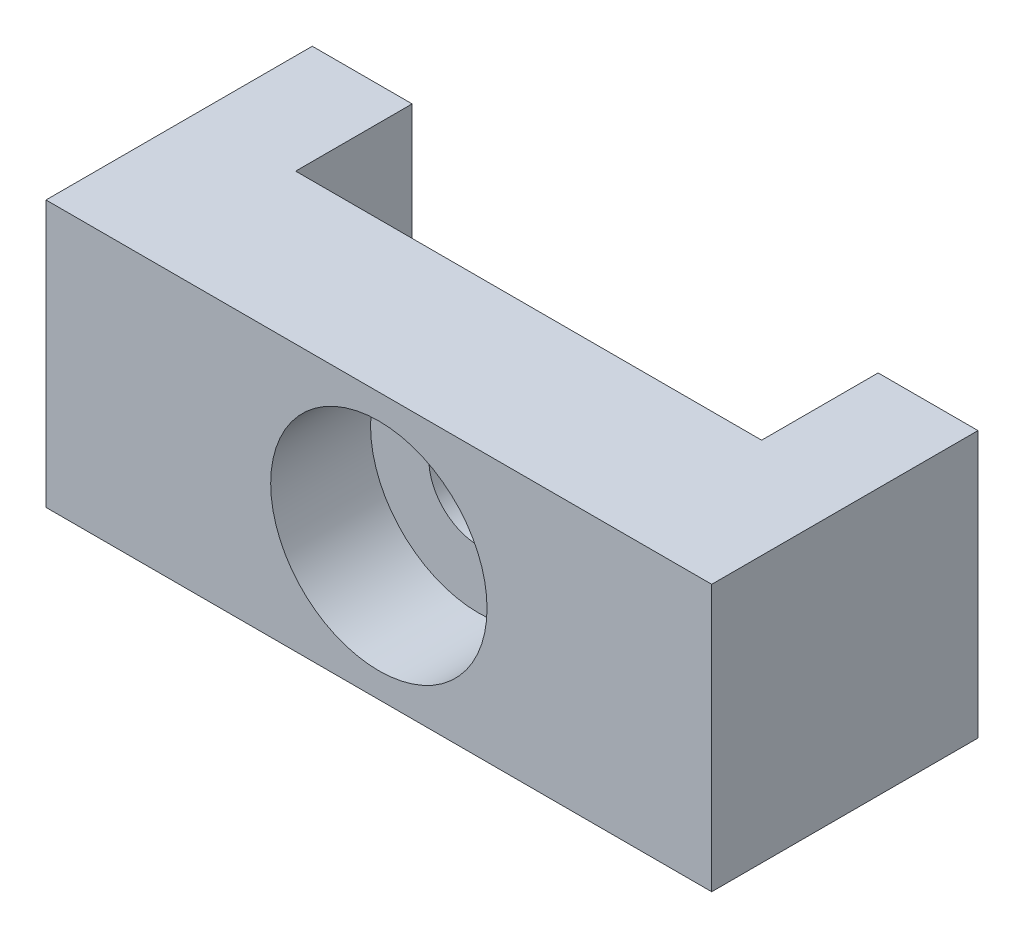
ISO-10303-21;
HEADER;
FILE_DESCRIPTION(('STEP AP214'),'2;1');
FILE_NAME('part.step','',(''),(''),'','','');
FILE_SCHEMA(('AUTOMOTIVE_DESIGN { 1 0 10303 214 1 1 1 1 }'));
ENDSEC;
DATA;
#1=APPLICATION_CONTEXT('core data for automotive mechanical design processes');
#2=APPLICATION_PROTOCOL_DEFINITION('international standard','automotive_design',2000,#1);
#3=PRODUCT_CONTEXT('',#1,'mechanical');
#4=PRODUCT('Part','Part','',(#3));
#5=PRODUCT_RELATED_PRODUCT_CATEGORY('part','',(#4));
#6=PRODUCT_DEFINITION_FORMATION('','',#4);
#7=PRODUCT_DEFINITION_CONTEXT('part definition',#1,'design');
#8=PRODUCT_DEFINITION('design','',#6,#7);
#9=PRODUCT_DEFINITION_SHAPE('','',#8);
#10=(LENGTH_UNIT() NAMED_UNIT(*) SI_UNIT(.MILLI.,.METRE.));
#11=(NAMED_UNIT(*) PLANE_ANGLE_UNIT() SI_UNIT($,.RADIAN.));
#12=(NAMED_UNIT(*) SI_UNIT($,.STERADIAN.) SOLID_ANGLE_UNIT());
#13=UNCERTAINTY_MEASURE_WITH_UNIT(LENGTH_MEASURE(1.E-05),#10,'distance_accuracy_value','');
#14=(GEOMETRIC_REPRESENTATION_CONTEXT(3) GLOBAL_UNCERTAINTY_ASSIGNED_CONTEXT((#13)) GLOBAL_UNIT_ASSIGNED_CONTEXT((#10,
#11,#12)) REPRESENTATION_CONTEXT('',''));
#15=CARTESIAN_POINT('',(0.,0.,0.));
#16=DIRECTION('',(0.,0.,1.));
#17=DIRECTION('',(1.,0.,0.));
#18=AXIS2_PLACEMENT_3D('',#15,#16,#17);
#19=CARTESIAN_POINT('',(0.,0.,-8.));
#20=DIRECTION('',(0.,0.,1.));
#21=DIRECTION('',(1.,0.,0.));
#22=AXIS2_PLACEMENT_3D('',#19,#20,#21);
#23=PLANE('',#22);
#24=DIRECTION('',(-1.,0.,0.));
#25=VECTOR('',#24,1.);
#26=CARTESIAN_POINT('',(10.,4.,-8.));
#27=LINE('',#26,#25);
#28=CARTESIAN_POINT('',(-7.,4.,-8.));
#29=VERTEX_POINT('',#28);
#30=CARTESIAN_POINT('',(-10.,4.,-8.));
#31=VERTEX_POINT('',#30);
#32=EDGE_CURVE('E58',#29,#31,#27,.T.);
#33=ORIENTED_EDGE('',*,*,#32,.F.);
#34=DIRECTION('',(0.,1.,0.));
#35=VECTOR('',#34,1.);
#36=CARTESIAN_POINT('',(-7.,-4.,-8.));
#37=LINE('',#36,#35);
#38=CARTESIAN_POINT('',(-7.,-4.,-8.));
#39=VERTEX_POINT('',#38);
#40=EDGE_CURVE('E111',#39,#29,#37,.T.);
#41=ORIENTED_EDGE('',*,*,#40,.F.);
#42=DIRECTION('',(1.,0.,0.));
#43=VECTOR('',#42,1.);
#44=CARTESIAN_POINT('',(10.,-4.,-8.));
#45=LINE('',#44,#43);
#46=CARTESIAN_POINT('',(-10.,-4.,-8.));
#47=VERTEX_POINT('',#46);
#48=EDGE_CURVE('E146',#47,#39,#45,.T.);
#49=ORIENTED_EDGE('',*,*,#48,.F.);
#50=DIRECTION('',(0.,-1.,0.));
#51=VECTOR('',#50,1.);
#52=CARTESIAN_POINT('',(-10.,-4.,-8.));
#53=LINE('',#52,#51);
#54=EDGE_CURVE('E141',#31,#47,#53,.T.);
#55=ORIENTED_EDGE('',*,*,#54,.F.);
#56=EDGE_LOOP('',(#33,#41,#49,#55));
#57=FACE_BOUND('',#56,.T.);
#58=ADVANCED_FACE('F33',(#57),#23,.F.);
#59=CARTESIAN_POINT('',(-10.,-4.,-8.));
#60=DIRECTION('',(-1.,0.,0.));
#61=DIRECTION('',(0.,0.,1.));
#62=AXIS2_PLACEMENT_3D('',#59,#60,#61);
#63=PLANE('',#62);
#64=DIRECTION('',(0.,-1.,0.));
#65=VECTOR('',#64,1.);
#66=CARTESIAN_POINT('',(-10.,-4.,0.));
#67=LINE('',#66,#65);
#68=CARTESIAN_POINT('',(-10.,4.,0.));
#69=VERTEX_POINT('',#68);
#70=CARTESIAN_POINT('',(-10.,-4.,0.));
#71=VERTEX_POINT('',#70);
#72=EDGE_CURVE('E136',#69,#71,#67,.T.);
#73=ORIENTED_EDGE('',*,*,#72,.F.);
#74=DIRECTION('',(0.,0.,1.));
#75=VECTOR('',#74,1.);
#76=CARTESIAN_POINT('',(-10.,4.,-8.));
#77=LINE('',#76,#75);
#78=EDGE_CURVE('E11',#31,#69,#77,.T.);
#79=ORIENTED_EDGE('',*,*,#78,.F.);
#80=ORIENTED_EDGE('',*,*,#54,.T.);
#81=DIRECTION('',(0.,0.,1.));
#82=VECTOR('',#81,1.);
#83=CARTESIAN_POINT('',(-10.,-4.,-8.));
#84=LINE('',#83,#82);
#85=EDGE_CURVE('E83',#47,#71,#84,.T.);
#86=ORIENTED_EDGE('',*,*,#85,.T.);
#87=EDGE_LOOP('',(#73,#79,#80,#86));
#88=FACE_BOUND('',#87,.T.);
#89=ADVANCED_FACE('F35',(#88),#63,.T.);
#90=CARTESIAN_POINT('',(10.,4.,-8.));
#91=DIRECTION('',(0.,1.,0.));
#92=DIRECTION('',(-1.,0.,0.));
#93=AXIS2_PLACEMENT_3D('',#90,#91,#92);
#94=PLANE('',#93);
#95=DIRECTION('',(0.,0.,-1.));
#96=VECTOR('',#95,1.);
#97=CARTESIAN_POINT('',(-7.,4.,-4.5));
#98=LINE('',#97,#96);
#99=CARTESIAN_POINT('',(-7.,4.,-4.5));
#100=VERTEX_POINT('',#99);
#101=EDGE_CURVE('E105',#100,#29,#98,.T.);
#102=ORIENTED_EDGE('',*,*,#101,.T.);
#103=ORIENTED_EDGE('',*,*,#32,.T.);
#104=ORIENTED_EDGE('',*,*,#78,.T.);
#105=DIRECTION('',(-1.,0.,0.));
#106=VECTOR('',#105,1.);
#107=CARTESIAN_POINT('',(10.,4.,0.));
#108=LINE('',#107,#106);
#109=CARTESIAN_POINT('',(10.,4.,0.));
#110=VERTEX_POINT('',#109);
#111=EDGE_CURVE('E145',#110,#69,#108,.T.);
#112=ORIENTED_EDGE('',*,*,#111,.F.);
#113=DIRECTION('',(0.,0.,1.));
#114=VECTOR('',#113,1.);
#115=CARTESIAN_POINT('',(10.,4.,-8.));
#116=LINE('',#115,#114);
#117=CARTESIAN_POINT('',(10.,4.,-8.));
#118=VERTEX_POINT('',#117);
#119=EDGE_CURVE('E42',#118,#110,#116,.T.);
#120=ORIENTED_EDGE('',*,*,#119,.F.);
#121=CARTESIAN_POINT('',(7.,4.,-8.));
#122=VERTEX_POINT('',#121);
#123=EDGE_CURVE('E151',#118,#122,#27,.T.);
#124=ORIENTED_EDGE('',*,*,#123,.T.);
#125=DIRECTION('',(0.,0.,-1.));
#126=VECTOR('',#125,1.);
#127=CARTESIAN_POINT('',(7.,4.,-4.5));
#128=LINE('',#127,#126);
#129=CARTESIAN_POINT('',(7.,4.,-4.5));
#130=VERTEX_POINT('',#129);
#131=EDGE_CURVE('E50',#130,#122,#128,.T.);
#132=ORIENTED_EDGE('',*,*,#131,.F.);
#133=DIRECTION('',(1.,0.,0.));
#134=VECTOR('',#133,1.);
#135=CARTESIAN_POINT('',(7.,4.,-4.5));
#136=LINE('',#135,#134);
#137=EDGE_CURVE('E119',#100,#130,#136,.T.);
#138=ORIENTED_EDGE('',*,*,#137,.F.);
#139=EDGE_LOOP('',(#102,#103,#104,#112,#120,#124,#132,#138));
#140=FACE_BOUND('',#139,.T.);
#141=ADVANCED_FACE('F124',(#140),#94,.T.);
#142=CARTESIAN_POINT('',(10.,-4.,-8.));
#143=DIRECTION('',(1.,0.,0.));
#144=DIRECTION('',(0.,0.,-1.));
#145=AXIS2_PLACEMENT_3D('',#142,#143,#144);
#146=PLANE('',#145);
#147=DIRECTION('',(0.,1.,0.));
#148=VECTOR('',#147,1.);
#149=CARTESIAN_POINT('',(10.,-4.,0.));
#150=LINE('',#149,#148);
#151=CARTESIAN_POINT('',(10.,-4.,0.));
#152=VERTEX_POINT('',#151);
#153=EDGE_CURVE('E158',#152,#110,#150,.T.);
#154=ORIENTED_EDGE('',*,*,#153,.F.);
#155=DIRECTION('',(0.,0.,1.));
#156=VECTOR('',#155,1.);
#157=CARTESIAN_POINT('',(10.,-4.,-8.));
#158=LINE('',#157,#156);
#159=CARTESIAN_POINT('',(10.,-4.,-8.));
#160=VERTEX_POINT('',#159);
#161=EDGE_CURVE('E164',#160,#152,#158,.T.);
#162=ORIENTED_EDGE('',*,*,#161,.F.);
#163=DIRECTION('',(0.,1.,0.));
#164=VECTOR('',#163,1.);
#165=CARTESIAN_POINT('',(10.,-4.,-8.));
#166=LINE('',#165,#164);
#167=EDGE_CURVE('E148',#160,#118,#166,.T.);
#168=ORIENTED_EDGE('',*,*,#167,.T.);
#169=ORIENTED_EDGE('',*,*,#119,.T.);
#170=EDGE_LOOP('',(#154,#162,#168,#169));
#171=FACE_BOUND('',#170,.T.);
#172=ADVANCED_FACE('F175',(#171),#146,.T.);
#173=CARTESIAN_POINT('',(10.,-4.,-8.));
#174=DIRECTION('',(0.,-1.,0.));
#175=DIRECTION('',(1.,0.,0.));
#176=AXIS2_PLACEMENT_3D('',#173,#174,#175);
#177=PLANE('',#176);
#178=DIRECTION('',(0.,0.,-1.));
#179=VECTOR('',#178,1.);
#180=CARTESIAN_POINT('',(-7.,-4.,-4.5));
#181=LINE('',#180,#179);
#182=CARTESIAN_POINT('',(-7.,-4.,-4.5));
#183=VERTEX_POINT('',#182);
#184=EDGE_CURVE('E134',#183,#39,#181,.T.);
#185=ORIENTED_EDGE('',*,*,#184,.F.);
#186=DIRECTION('',(-1.,0.,0.));
#187=VECTOR('',#186,1.);
#188=CARTESIAN_POINT('',(7.,-4.,-4.5));
#189=LINE('',#188,#187);
#190=CARTESIAN_POINT('',(7.,-4.,-4.5));
#191=VERTEX_POINT('',#190);
#192=EDGE_CURVE('E113',#191,#183,#189,.T.);
#193=ORIENTED_EDGE('',*,*,#192,.F.);
#194=DIRECTION('',(0.,0.,-1.));
#195=VECTOR('',#194,1.);
#196=CARTESIAN_POINT('',(7.,-4.,-4.5));
#197=LINE('',#196,#195);
#198=CARTESIAN_POINT('',(7.,-4.,-8.));
#199=VERTEX_POINT('',#198);
#200=EDGE_CURVE('E137',#191,#199,#197,.T.);
#201=ORIENTED_EDGE('',*,*,#200,.T.);
#202=EDGE_CURVE('E144',#199,#160,#45,.T.);
#203=ORIENTED_EDGE('',*,*,#202,.T.);
#204=ORIENTED_EDGE('',*,*,#161,.T.);
#205=DIRECTION('',(1.,0.,0.));
#206=VECTOR('',#205,1.);
#207=CARTESIAN_POINT('',(10.,-4.,0.));
#208=LINE('',#207,#206);
#209=EDGE_CURVE('E155',#71,#152,#208,.T.);
#210=ORIENTED_EDGE('',*,*,#209,.F.);
#211=ORIENTED_EDGE('',*,*,#85,.F.);
#212=ORIENTED_EDGE('',*,*,#48,.T.);
#213=EDGE_LOOP('',(#185,#193,#201,#203,#204,#210,#211,#212));
#214=FACE_BOUND('',#213,.T.);
#215=ADVANCED_FACE('F167',(#214),#177,.T.);
#216=ORIENTED_EDGE('',*,*,#202,.F.);
#217=DIRECTION('',(0.,-1.,0.));
#218=VECTOR('',#217,1.);
#219=CARTESIAN_POINT('',(7.,-4.,-8.));
#220=LINE('',#219,#218);
#221=EDGE_CURVE('E122',#122,#199,#220,.T.);
#222=ORIENTED_EDGE('',*,*,#221,.F.);
#223=ORIENTED_EDGE('',*,*,#123,.F.);
#224=ORIENTED_EDGE('',*,*,#167,.F.);
#225=EDGE_LOOP('',(#216,#222,#223,#224));
#226=FACE_BOUND('',#225,.T.);
#227=ADVANCED_FACE('F178',(#226),#23,.F.);
#228=CARTESIAN_POINT('',(0.,0.,0.));
#229=DIRECTION('',(0.,0.,1.));
#230=DIRECTION('',(1.,0.,0.));
#231=AXIS2_PLACEMENT_3D('',#228,#229,#230);
#232=PLANE('',#231);
#233=CARTESIAN_POINT('',(0.,0.,0.));
#234=DIRECTION('',(0.,0.,1.));
#235=DIRECTION('',(1.,0.,0.));
#236=AXIS2_PLACEMENT_3D('',#233,#234,#235);
#237=CIRCLE('',#236,3.25);
#238=CARTESIAN_POINT('',(3.25,0.,0.));
#239=VERTEX_POINT('',#238);
#240=EDGE_CURVE('E286',#239,#239,#237,.T.);
#241=ORIENTED_EDGE('',*,*,#240,.F.);
#242=EDGE_LOOP('',(#241));
#243=FACE_BOUND('',#242,.T.);
#244=ORIENTED_EDGE('',*,*,#72,.T.);
#245=ORIENTED_EDGE('',*,*,#209,.T.);
#246=ORIENTED_EDGE('',*,*,#153,.T.);
#247=ORIENTED_EDGE('',*,*,#111,.T.);
#248=EDGE_LOOP('',(#244,#245,#246,#247));
#249=FACE_BOUND('',#248,.T.);
#250=ADVANCED_FACE('F171',(#243,#249),#232,.T.);
#251=CARTESIAN_POINT('',(-7.,-4.,-4.5));
#252=DIRECTION('',(-1.,0.,0.));
#253=DIRECTION('',(0.,0.,1.));
#254=AXIS2_PLACEMENT_3D('',#251,#252,#253);
#255=PLANE('',#254);
#256=ORIENTED_EDGE('',*,*,#40,.T.);
#257=ORIENTED_EDGE('',*,*,#101,.F.);
#258=DIRECTION('',(0.,1.,0.));
#259=VECTOR('',#258,1.);
#260=CARTESIAN_POINT('',(-7.,-4.,-4.5));
#261=LINE('',#260,#259);
#262=EDGE_CURVE('E108',#183,#100,#261,.T.);
#263=ORIENTED_EDGE('',*,*,#262,.F.);
#264=ORIENTED_EDGE('',*,*,#184,.T.);
#265=EDGE_LOOP('',(#256,#257,#263,#264));
#266=FACE_BOUND('',#265,.T.);
#267=ADVANCED_FACE('F107',(#266),#255,.F.);
#268=CARTESIAN_POINT('',(7.,-4.,-4.5));
#269=DIRECTION('',(1.,0.,0.));
#270=DIRECTION('',(0.,0.,-1.));
#271=AXIS2_PLACEMENT_3D('',#268,#269,#270);
#272=PLANE('',#271);
#273=ORIENTED_EDGE('',*,*,#221,.T.);
#274=ORIENTED_EDGE('',*,*,#200,.F.);
#275=DIRECTION('',(0.,-1.,0.));
#276=VECTOR('',#275,1.);
#277=CARTESIAN_POINT('',(7.,-4.,-4.5));
#278=LINE('',#277,#276);
#279=EDGE_CURVE('E126',#130,#191,#278,.T.);
#280=ORIENTED_EDGE('',*,*,#279,.F.);
#281=ORIENTED_EDGE('',*,*,#131,.T.);
#282=EDGE_LOOP('',(#273,#274,#280,#281));
#283=FACE_BOUND('',#282,.T.);
#284=ADVANCED_FACE('F179',(#283),#272,.F.);
#285=CARTESIAN_POINT('',(0.,0.,-4.5));
#286=DIRECTION('',(0.,0.,1.));
#287=DIRECTION('',(1.,0.,0.));
#288=AXIS2_PLACEMENT_3D('',#285,#286,#287);
#289=PLANE('',#288);
#290=CARTESIAN_POINT('',(0.,0.,-4.5));
#291=DIRECTION('',(0.,0.,1.));
#292=DIRECTION('',(1.,0.,0.));
#293=AXIS2_PLACEMENT_3D('',#290,#291,#292);
#294=CIRCLE('',#293,1.5);
#295=CARTESIAN_POINT('',(1.5,0.,-4.5));
#296=VERTEX_POINT('',#295);
#297=EDGE_CURVE('E37',#296,#296,#294,.T.);
#298=ORIENTED_EDGE('',*,*,#297,.T.);
#299=EDGE_LOOP('',(#298));
#300=FACE_BOUND('',#299,.T.);
#301=ORIENTED_EDGE('',*,*,#262,.T.);
#302=ORIENTED_EDGE('',*,*,#137,.T.);
#303=ORIENTED_EDGE('',*,*,#279,.T.);
#304=ORIENTED_EDGE('',*,*,#192,.T.);
#305=EDGE_LOOP('',(#301,#302,#303,#304));
#306=FACE_BOUND('',#305,.T.);
#307=ADVANCED_FACE('F117',(#300,#306),#289,.F.);
#308=CARTESIAN_POINT('',(0.,0.,0.));
#309=DIRECTION('',(0.,0.,1.));
#310=DIRECTION('',(1.,0.,0.));
#311=AXIS2_PLACEMENT_3D('',#308,#309,#310);
#312=CYLINDRICAL_SURFACE('',#311,1.5);
#313=CARTESIAN_POINT('',(0.,0.,-3.));
#314=DIRECTION('',(0.,0.,1.));
#315=DIRECTION('',(1.,0.,0.));
#316=AXIS2_PLACEMENT_3D('',#313,#314,#315);
#317=CIRCLE('',#316,1.5);
#318=CARTESIAN_POINT('',(1.5,0.,-3.));
#319=VERTEX_POINT('',#318);
#320=EDGE_CURVE('E288',#319,#319,#317,.T.);
#321=ORIENTED_EDGE('',*,*,#320,.T.);
#322=EDGE_LOOP('',(#321));
#323=FACE_BOUND('',#322,.T.);
#324=ORIENTED_EDGE('',*,*,#297,.F.);
#325=EDGE_LOOP('',(#324));
#326=FACE_BOUND('',#325,.T.);
#327=ADVANCED_FACE('F243',(#323,#326),#312,.F.);
#328=CARTESIAN_POINT('',(1.5,0.,-3.));
#329=DIRECTION('',(0.,0.,-1.));
#330=DIRECTION('',(-1.,0.,0.));
#331=AXIS2_PLACEMENT_3D('',#328,#329,#330);
#332=PLANE('',#331);
#333=ORIENTED_EDGE('',*,*,#320,.F.);
#334=EDGE_LOOP('',(#333));
#335=FACE_BOUND('',#334,.T.);
#336=CARTESIAN_POINT('',(0.,0.,-3.));
#337=DIRECTION('',(0.,0.,1.));
#338=DIRECTION('',(1.,0.,0.));
#339=AXIS2_PLACEMENT_3D('',#336,#337,#338);
#340=CIRCLE('',#339,3.25);
#341=CARTESIAN_POINT('',(3.25,0.,-3.));
#342=VERTEX_POINT('',#341);
#343=EDGE_CURVE('E283',#342,#342,#340,.T.);
#344=ORIENTED_EDGE('',*,*,#343,.T.);
#345=EDGE_LOOP('',(#344));
#346=FACE_BOUND('',#345,.T.);
#347=ADVANCED_FACE('F252',(#335,#346),#332,.F.);
#348=CARTESIAN_POINT('',(0.,0.,0.));
#349=DIRECTION('',(0.,0.,1.));
#350=DIRECTION('',(1.,0.,0.));
#351=AXIS2_PLACEMENT_3D('',#348,#349,#350);
#352=CYLINDRICAL_SURFACE('',#351,3.25);
#353=ORIENTED_EDGE('',*,*,#343,.F.);
#354=EDGE_LOOP('',(#353));
#355=FACE_BOUND('',#354,.T.);
#356=ORIENTED_EDGE('',*,*,#240,.T.);
#357=EDGE_LOOP('',(#356));
#358=FACE_BOUND('',#357,.T.);
#359=ADVANCED_FACE('F261',(#355,#358),#352,.F.);
#360=CLOSED_SHELL('',(#58,#89,#141,#172,#215,#227,#250,#267,#284,#307,#327,#347,#359));
#361=MANIFOLD_SOLID_BREP('B2',#360);
#362=ADVANCED_BREP_SHAPE_REPRESENTATION('',(#18,#361),#14);
#363=SHAPE_DEFINITION_REPRESENTATION(#9,#362);
ENDSEC;
END-ISO-10303-21;
